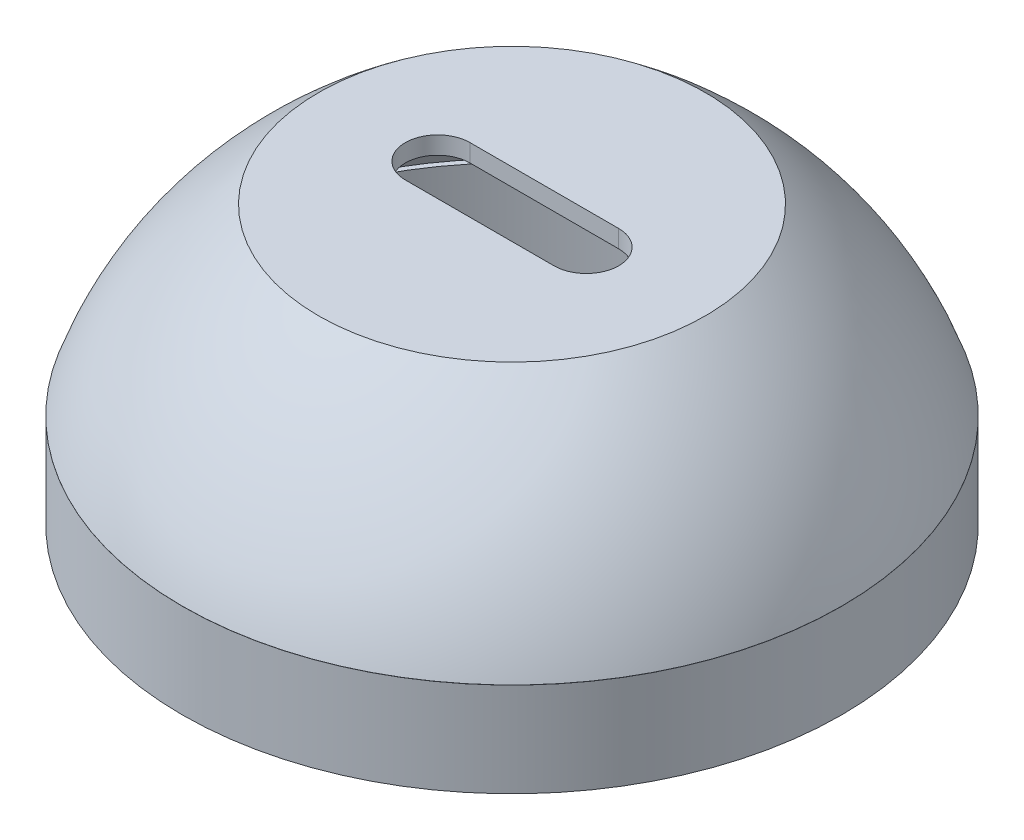
ISO-10303-21;
HEADER;
FILE_DESCRIPTION(('STEP AP214'),'2;1');
FILE_NAME('part.step','',(''),(''),'','','');
FILE_SCHEMA(('AUTOMOTIVE_DESIGN { 1 0 10303 214 1 1 1 1 }'));
ENDSEC;
DATA;
#1=APPLICATION_CONTEXT('core data for automotive mechanical design processes');
#2=APPLICATION_PROTOCOL_DEFINITION('international standard','automotive_design',2000,#1);
#3=PRODUCT_CONTEXT('',#1,'mechanical');
#4=PRODUCT('Part','Part','',(#3));
#5=PRODUCT_RELATED_PRODUCT_CATEGORY('part','',(#4));
#6=PRODUCT_DEFINITION_FORMATION('','',#4);
#7=PRODUCT_DEFINITION_CONTEXT('part definition',#1,'design');
#8=PRODUCT_DEFINITION('design','',#6,#7);
#9=PRODUCT_DEFINITION_SHAPE('','',#8);
#10=(LENGTH_UNIT() NAMED_UNIT(*) SI_UNIT(.MILLI.,.METRE.));
#11=(NAMED_UNIT(*) PLANE_ANGLE_UNIT() SI_UNIT($,.RADIAN.));
#12=(NAMED_UNIT(*) SI_UNIT($,.STERADIAN.) SOLID_ANGLE_UNIT());
#13=UNCERTAINTY_MEASURE_WITH_UNIT(LENGTH_MEASURE(1.E-05),#10,'distance_accuracy_value','');
#14=(GEOMETRIC_REPRESENTATION_CONTEXT(3) GLOBAL_UNCERTAINTY_ASSIGNED_CONTEXT((#13)) GLOBAL_UNIT_ASSIGNED_CONTEXT((#10,
#11,#12)) REPRESENTATION_CONTEXT('',''));
#15=CARTESIAN_POINT('',(0.,0.,0.));
#16=DIRECTION('',(0.,0.,1.));
#17=DIRECTION('',(1.,0.,0.));
#18=AXIS2_PLACEMENT_3D('',#15,#16,#17);
#19=CARTESIAN_POINT('',(0.,0.,0.));
#20=DIRECTION('',(0.,1.,0.));
#21=DIRECTION('',(0.,0.,1.));
#22=AXIS2_PLACEMENT_3D('',#19,#20,#21);
#23=CYLINDRICAL_SURFACE('',#22,46.4680210404627);
#24=CARTESIAN_POINT('',(0.,-41.6006520223511,0.));
#25=DIRECTION('',(0.,1.,0.));
#26=DIRECTION('',(0.,0.,1.));
#27=AXIS2_PLACEMENT_3D('',#24,#25,#26);
#28=CIRCLE('',#27,46.4680210404627);
#29=CARTESIAN_POINT('',(0.,-41.6006520223511,46.4680210404627));
#30=VERTEX_POINT('',#29);
#31=EDGE_CURVE('E59',#30,#30,#28,.T.);
#32=ORIENTED_EDGE('',*,*,#31,.F.);
#33=EDGE_LOOP('',(#32));
#34=FACE_BOUND('',#33,.T.);
#35=CARTESIAN_POINT('',(0.,-27.4917327533832,0.));
#36=DIRECTION('',(0.,1.,0.));
#37=DIRECTION('',(0.,0.,1.));
#38=AXIS2_PLACEMENT_3D('',#35,#36,#37);
#39=CIRCLE('',#38,46.4680210404627);
#40=CARTESIAN_POINT('',(0.,-27.4917327533832,46.4680210404627));
#41=VERTEX_POINT('',#40);
#42=EDGE_CURVE('E11',#41,#41,#39,.T.);
#43=ORIENTED_EDGE('',*,*,#42,.T.);
#44=EDGE_LOOP('',(#43));
#45=FACE_BOUND('',#44,.T.);
#46=ADVANCED_FACE('F45',(#34,#45),#23,.F.);
#47=CARTESIAN_POINT('',(46.4680210404627,-27.4917327533832,0.));
#48=DIRECTION('',(0.,-1.,0.));
#49=DIRECTION('',(0.,0.,-1.));
#50=AXIS2_PLACEMENT_3D('',#47,#48,#49);
#51=PLANE('',#50);
#52=ORIENTED_EDGE('',*,*,#42,.F.);
#53=EDGE_LOOP('',(#52));
#54=FACE_BOUND('',#53,.T.);
#55=CARTESIAN_POINT('',(0.,-27.4917327533832,0.));
#56=DIRECTION('',(0.,1.,0.));
#57=DIRECTION('',(0.,0.,1.));
#58=AXIS2_PLACEMENT_3D('',#55,#56,#57);
#59=CIRCLE('',#58,49.4328532710341);
#60=CARTESIAN_POINT('',(0.,-27.4917327533832,49.4328532710341));
#61=VERTEX_POINT('',#60);
#62=EDGE_CURVE('E51',#61,#61,#59,.T.);
#63=ORIENTED_EDGE('',*,*,#62,.T.);
#64=EDGE_LOOP('',(#63));
#65=FACE_BOUND('',#64,.T.);
#66=ADVANCED_FACE('F68',(#54,#65),#51,.F.);
#67=CARTESIAN_POINT('',(0.,0.,0.));
#68=DIRECTION('',(0.,1.,0.));
#69=DIRECTION('',(0.,0.,1.));
#70=AXIS2_PLACEMENT_3D('',#67,#68,#69);
#71=CYLINDRICAL_SURFACE('',#70,49.4328532710341);
#72=ORIENTED_EDGE('',*,*,#62,.F.);
#73=EDGE_LOOP('',(#72));
#74=FACE_BOUND('',#73,.T.);
#75=CARTESIAN_POINT('',(0.,-41.6006520223511,0.));
#76=DIRECTION('',(0.,1.,0.));
#77=DIRECTION('',(0.,0.,1.));
#78=AXIS2_PLACEMENT_3D('',#75,#76,#77);
#79=CIRCLE('',#78,49.4328532710341);
#80=CARTESIAN_POINT('',(0.,-41.6006520223511,49.4328532710341));
#81=VERTEX_POINT('',#80);
#82=EDGE_CURVE('E55',#81,#81,#79,.T.);
#83=ORIENTED_EDGE('',*,*,#82,.T.);
#84=EDGE_LOOP('',(#83));
#85=FACE_BOUND('',#84,.T.);
#86=ADVANCED_FACE('F72',(#74,#85),#71,.T.);
#87=CARTESIAN_POINT('',(49.4328532710341,-41.6006520223511,0.));
#88=DIRECTION('',(0.,1.,0.));
#89=DIRECTION('',(0.,0.,1.));
#90=AXIS2_PLACEMENT_3D('',#87,#88,#89);
#91=PLANE('',#90);
#92=ORIENTED_EDGE('',*,*,#82,.F.);
#93=EDGE_LOOP('',(#92));
#94=FACE_BOUND('',#93,.T.);
#95=ORIENTED_EDGE('',*,*,#31,.T.);
#96=EDGE_LOOP('',(#95));
#97=FACE_BOUND('',#96,.T.);
#98=ADVANCED_FACE('F65',(#94,#97),#91,.F.);
#99=CLOSED_SHELL('',(#46,#66,#86,#98));
#100=MANIFOLD_SOLID_BREP('B2',#99);
#101=CARTESIAN_POINT('',(0.,0.,0.));
#102=DIRECTION('',(0.,-1.,0.));
#103=DIRECTION('',(0.,0.,-1.));
#104=AXIS2_PLACEMENT_3D('',#101,#102,#103);
#105=PLANE('',#104);
#106=DIRECTION('',(1.,0.,0.));
#107=VECTOR('',#106,1.);
#108=CARTESIAN_POINT('',(-11.15,0.,4.85));
#109=LINE('',#108,#107);
#110=CARTESIAN_POINT('',(-11.15,0.,4.85));
#111=VERTEX_POINT('',#110);
#112=CARTESIAN_POINT('',(11.15,0.,4.85));
#113=VERTEX_POINT('',#112);
#114=EDGE_CURVE('E167',#111,#113,#109,.T.);
#115=ORIENTED_EDGE('',*,*,#114,.F.);
#116=CARTESIAN_POINT('',(-11.15,0.,0.));
#117=DIRECTION('',(0.,1.,0.));
#118=DIRECTION('',(0.,0.,1.));
#119=AXIS2_PLACEMENT_3D('',#116,#117,#118);
#120=CIRCLE('',#119,4.85);
#121=CARTESIAN_POINT('',(-11.15,0.,-4.85));
#122=VERTEX_POINT('',#121);
#123=EDGE_CURVE('E129',#122,#111,#120,.T.);
#124=ORIENTED_EDGE('',*,*,#123,.F.);
#125=DIRECTION('',(-1.,0.,0.));
#126=VECTOR('',#125,1.);
#127=CARTESIAN_POINT('',(-11.15,0.,-4.85));
#128=LINE('',#127,#126);
#129=CARTESIAN_POINT('',(11.15,0.,-4.85));
#130=VERTEX_POINT('',#129);
#131=EDGE_CURVE('E173',#130,#122,#128,.T.);
#132=ORIENTED_EDGE('',*,*,#131,.F.);
#133=CARTESIAN_POINT('',(11.15,0.,0.));
#134=DIRECTION('',(0.,1.,0.));
#135=DIRECTION('',(0.,0.,1.));
#136=AXIS2_PLACEMENT_3D('',#133,#134,#135);
#137=CIRCLE('',#136,4.85);
#138=EDGE_CURVE('E158',#113,#130,#137,.T.);
#139=ORIENTED_EDGE('',*,*,#138,.F.);
#140=EDGE_LOOP('',(#115,#124,#132,#139));
#141=FACE_BOUND('',#140,.T.);
#142=CARTESIAN_POINT('',(0.,0.,0.));
#143=DIRECTION('',(0.,1.,0.));
#144=DIRECTION('',(0.,0.,1.));
#145=AXIS2_PLACEMENT_3D('',#142,#143,#144);
#146=CIRCLE('',#145,29.);
#147=CARTESIAN_POINT('',(0.,0.,29.));
#148=VERTEX_POINT('',#147);
#149=EDGE_CURVE('E214',#148,#148,#146,.T.);
#150=ORIENTED_EDGE('',*,*,#149,.T.);
#151=EDGE_LOOP('',(#150));
#152=FACE_BOUND('',#151,.T.);
#153=ADVANCED_FACE('F115',(#141,#152),#105,.F.);
#154=CARTESIAN_POINT('',(49.4328532710341,-27.473975523424,0.));
#155=CARTESIAN_POINT('',(43.9738567748424,-11.4036078474435,0.));
#156=CARTESIAN_POINT('',(29.,0.,0.));
#157=B_SPLINE_CURVE_WITH_KNOTS('',2,(#154,#155,#156),.UNSPECIFIED.,.F.,.F.,(3,3),(0.,
0.848255364200897),.UNSPECIFIED.);
#158=CARTESIAN_POINT('',(0.,39.6926481385239,0.));
#159=DIRECTION('',(0.,1.,0.));
#160=AXIS1_PLACEMENT('',#158,#159);
#161=SURFACE_OF_REVOLUTION('',#157,#160);
#162=ORIENTED_EDGE('',*,*,#149,.F.);
#163=EDGE_LOOP('',(#162));
#164=FACE_BOUND('',#163,.T.);
#165=CARTESIAN_POINT('',(0.,-27.473975523424,0.));
#166=DIRECTION('',(0.,1.,0.));
#167=DIRECTION('',(0.,0.,1.));
#168=AXIS2_PLACEMENT_3D('',#165,#166,#167);
#169=CIRCLE('',#168,49.4328532710341);
#170=CARTESIAN_POINT('',(0.,-27.473975523424,49.4328532710341));
#171=VERTEX_POINT('',#170);
#172=EDGE_CURVE('E217',#171,#171,#169,.T.);
#173=ORIENTED_EDGE('',*,*,#172,.T.);
#174=EDGE_LOOP('',(#173));
#175=FACE_BOUND('',#174,.T.);
#176=ADVANCED_FACE('F204',(#164,#175),#161,.T.);
#177=CARTESIAN_POINT('',(47.2249273708719,-27.473975523424,0.));
#178=DIRECTION('',(0.,1.,0.));
#179=DIRECTION('',(0.,0.,1.));
#180=AXIS2_PLACEMENT_3D('',#177,#178,#179);
#181=PLANE('',#180);
#182=ORIENTED_EDGE('',*,*,#172,.F.);
#183=EDGE_LOOP('',(#182));
#184=FACE_BOUND('',#183,.T.);
#185=CARTESIAN_POINT('',(0.,-27.473975523424,0.));
#186=DIRECTION('',(0.,1.,0.));
#187=DIRECTION('',(0.,0.,1.));
#188=AXIS2_PLACEMENT_3D('',#185,#186,#187);
#189=CIRCLE('',#188,47.2249273708719);
#190=CARTESIAN_POINT('',(0.,-27.473975523424,47.2249273708719));
#191=VERTEX_POINT('',#190);
#192=EDGE_CURVE('E218',#191,#191,#189,.T.);
#193=ORIENTED_EDGE('',*,*,#192,.T.);
#194=EDGE_LOOP('',(#193));
#195=FACE_BOUND('',#194,.T.);
#196=ADVANCED_FACE('F200',(#184,#195),#181,.F.);
#197=CARTESIAN_POINT('',(27.5909193429916,-2.64345538691186,0.));
#198=CARTESIAN_POINT('',(40.2352151759901,-12.0813446266558,0.));
#199=CARTESIAN_POINT('',(47.2249273708719,-27.473975523424,0.));
#200=B_SPLINE_CURVE_WITH_KNOTS('',2,(#197,#198,#199),.UNSPECIFIED.,.F.,.F.,(3,3),(0.,
0.915287791056726),.UNSPECIFIED.);
#201=CARTESIAN_POINT('',(0.,39.6926481385239,0.));
#202=DIRECTION('',(0.,1.,0.));
#203=AXIS1_PLACEMENT('',#201,#202);
#204=SURFACE_OF_REVOLUTION('',#200,#203);
#205=ORIENTED_EDGE('',*,*,#192,.F.);
#206=EDGE_LOOP('',(#205));
#207=FACE_BOUND('',#206,.T.);
#208=CARTESIAN_POINT('',(0.,-2.64345538691186,0.));
#209=DIRECTION('',(0.,1.,0.));
#210=DIRECTION('',(0.,0.,1.));
#211=AXIS2_PLACEMENT_3D('',#208,#209,#210);
#212=CIRCLE('',#211,27.5909193429916);
#213=CARTESIAN_POINT('',(0.,-2.64345538691186,27.5909193429916));
#214=VERTEX_POINT('',#213);
#215=EDGE_CURVE('E180',#214,#214,#212,.T.);
#216=ORIENTED_EDGE('',*,*,#215,.T.);
#217=EDGE_LOOP('',(#216));
#218=FACE_BOUND('',#217,.T.);
#219=ADVANCED_FACE('F195',(#207,#218),#204,.T.);
#220=CARTESIAN_POINT('',(0.,-2.64345538691186,0.));
#221=DIRECTION('',(0.,1.,0.));
#222=DIRECTION('',(0.,0.,1.));
#223=AXIS2_PLACEMENT_3D('',#220,#221,#222);
#224=PLANE('',#223);
#225=DIRECTION('',(-1.,0.,0.));
#226=VECTOR('',#225,1.);
#227=CARTESIAN_POINT('',(0.,-2.64345538691186,-4.85));
#228=LINE('',#227,#226);
#229=CARTESIAN_POINT('',(11.15,-2.64345538691186,-4.85));
#230=VERTEX_POINT('',#229);
#231=CARTESIAN_POINT('',(-11.15,-2.64345538691186,-4.85));
#232=VERTEX_POINT('',#231);
#233=EDGE_CURVE('E122',#230,#232,#228,.T.);
#234=ORIENTED_EDGE('',*,*,#233,.T.);
#235=CARTESIAN_POINT('',(-11.15,-2.64345538691186,0.));
#236=DIRECTION('',(0.,1.,0.));
#237=DIRECTION('',(0.,0.,1.));
#238=AXIS2_PLACEMENT_3D('',#235,#236,#237);
#239=CIRCLE('',#238,4.85);
#240=CARTESIAN_POINT('',(-11.15,-2.64345538691186,4.85));
#241=VERTEX_POINT('',#240);
#242=EDGE_CURVE('E43',#232,#241,#239,.T.);
#243=ORIENTED_EDGE('',*,*,#242,.T.);
#244=DIRECTION('',(1.,0.,0.));
#245=VECTOR('',#244,1.);
#246=CARTESIAN_POINT('',(0.,-2.64345538691186,4.85));
#247=LINE('',#246,#245);
#248=CARTESIAN_POINT('',(11.15,-2.64345538691186,4.85));
#249=VERTEX_POINT('',#248);
#250=EDGE_CURVE('E220',#241,#249,#247,.T.);
#251=ORIENTED_EDGE('',*,*,#250,.T.);
#252=CARTESIAN_POINT('',(11.15,-2.64345538691186,0.));
#253=DIRECTION('',(0.,1.,0.));
#254=DIRECTION('',(0.,0.,1.));
#255=AXIS2_PLACEMENT_3D('',#252,#253,#254);
#256=CIRCLE('',#255,4.85);
#257=EDGE_CURVE('E161',#249,#230,#256,.T.);
#258=ORIENTED_EDGE('',*,*,#257,.T.);
#259=EDGE_LOOP('',(#234,#243,#251,#258));
#260=FACE_BOUND('',#259,.T.);
#261=ORIENTED_EDGE('',*,*,#215,.F.);
#262=EDGE_LOOP('',(#261));
#263=FACE_BOUND('',#262,.T.);
#264=ADVANCED_FACE('F199',(#260,#263),#224,.F.);
#265=CARTESIAN_POINT('',(-11.15,-10.,0.));
#266=DIRECTION('',(0.,1.,0.));
#267=DIRECTION('',(0.,0.,1.));
#268=AXIS2_PLACEMENT_3D('',#265,#266,#267);
#269=CYLINDRICAL_SURFACE('',#268,4.85);
#270=DIRECTION('',(0.,1.,0.));
#271=VECTOR('',#270,1.);
#272=CARTESIAN_POINT('',(-11.15,-10.,-4.85));
#273=LINE('',#272,#271);
#274=EDGE_CURVE('E178',#232,#122,#273,.T.);
#275=ORIENTED_EDGE('',*,*,#274,.T.);
#276=ORIENTED_EDGE('',*,*,#123,.T.);
#277=DIRECTION('',(0.,1.,0.));
#278=VECTOR('',#277,1.);
#279=CARTESIAN_POINT('',(-11.15,-10.,4.85));
#280=LINE('',#279,#278);
#281=EDGE_CURVE('E164',#241,#111,#280,.T.);
#282=ORIENTED_EDGE('',*,*,#281,.F.);
#283=ORIENTED_EDGE('',*,*,#242,.F.);
#284=EDGE_LOOP('',(#275,#276,#282,#283));
#285=FACE_BOUND('',#284,.T.);
#286=ADVANCED_FACE('F232',(#285),#269,.F.);
#287=CARTESIAN_POINT('',(-11.15,-10.,-4.85));
#288=DIRECTION('',(0.,0.,-1.));
#289=DIRECTION('',(-1.,0.,0.));
#290=AXIS2_PLACEMENT_3D('',#287,#288,#289);
#291=PLANE('',#290);
#292=DIRECTION('',(0.,1.,0.));
#293=VECTOR('',#292,1.);
#294=CARTESIAN_POINT('',(11.15,-10.,-4.85));
#295=LINE('',#294,#293);
#296=EDGE_CURVE('E163',#230,#130,#295,.T.);
#297=ORIENTED_EDGE('',*,*,#296,.T.);
#298=ORIENTED_EDGE('',*,*,#131,.T.);
#299=ORIENTED_EDGE('',*,*,#274,.F.);
#300=ORIENTED_EDGE('',*,*,#233,.F.);
#301=EDGE_LOOP('',(#297,#298,#299,#300));
#302=FACE_BOUND('',#301,.T.);
#303=ADVANCED_FACE('F231',(#302),#291,.F.);
#304=CARTESIAN_POINT('',(11.15,-10.,0.));
#305=DIRECTION('',(0.,1.,0.));
#306=DIRECTION('',(0.,0.,1.));
#307=AXIS2_PLACEMENT_3D('',#304,#305,#306);
#308=CYLINDRICAL_SURFACE('',#307,4.85);
#309=DIRECTION('',(0.,1.,0.));
#310=VECTOR('',#309,1.);
#311=CARTESIAN_POINT('',(11.15,-10.,4.85));
#312=LINE('',#311,#310);
#313=EDGE_CURVE('E137',#249,#113,#312,.T.);
#314=ORIENTED_EDGE('',*,*,#313,.T.);
#315=ORIENTED_EDGE('',*,*,#138,.T.);
#316=ORIENTED_EDGE('',*,*,#296,.F.);
#317=ORIENTED_EDGE('',*,*,#257,.F.);
#318=EDGE_LOOP('',(#314,#315,#316,#317));
#319=FACE_BOUND('',#318,.T.);
#320=ADVANCED_FACE('F155',(#319),#308,.F.);
#321=CARTESIAN_POINT('',(-11.15,-10.,4.85));
#322=DIRECTION('',(0.,0.,1.));
#323=DIRECTION('',(1.,0.,0.));
#324=AXIS2_PLACEMENT_3D('',#321,#322,#323);
#325=PLANE('',#324);
#326=ORIENTED_EDGE('',*,*,#281,.T.);
#327=ORIENTED_EDGE('',*,*,#114,.T.);
#328=ORIENTED_EDGE('',*,*,#313,.F.);
#329=ORIENTED_EDGE('',*,*,#250,.F.);
#330=EDGE_LOOP('',(#326,#327,#328,#329));
#331=FACE_BOUND('',#330,.T.);
#332=ADVANCED_FACE('F168',(#331),#325,.F.);
#333=CLOSED_SHELL('',(#153,#176,#196,#219,#264,#286,#303,#320,#332));
#334=MANIFOLD_SOLID_BREP('B6',#333);
#335=ADVANCED_BREP_SHAPE_REPRESENTATION('',(#18,#100,#334),#14);
#336=SHAPE_DEFINITION_REPRESENTATION(#9,#335);
ENDSEC;
END-ISO-10303-21;
